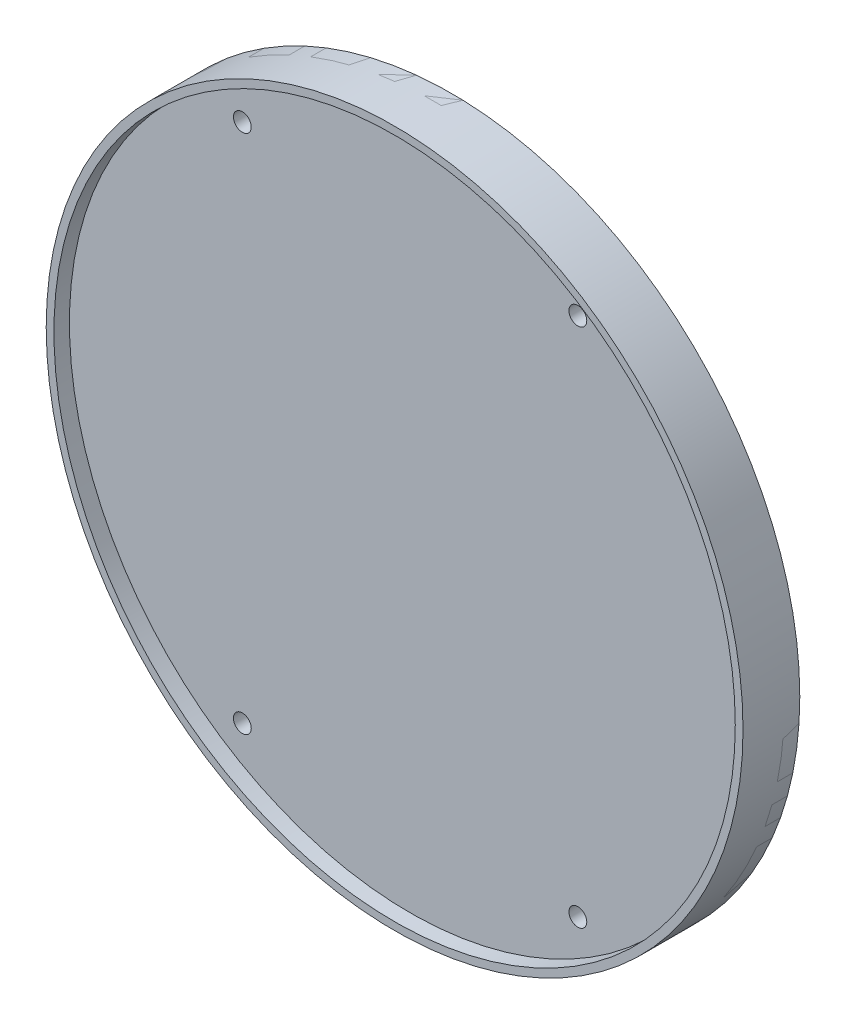
ISO-10303-21;
HEADER;
FILE_DESCRIPTION(('STEP AP214'),'2;1');
FILE_NAME('part.step','',(''),(''),'','','');
FILE_SCHEMA(('AUTOMOTIVE_DESIGN { 1 0 10303 214 1 1 1 1 }'));
ENDSEC;
DATA;
#1=APPLICATION_CONTEXT('core data for automotive mechanical design processes');
#2=APPLICATION_PROTOCOL_DEFINITION('international standard','automotive_design',2000,#1);
#3=PRODUCT_CONTEXT('',#1,'mechanical');
#4=PRODUCT('Part','Part','',(#3));
#5=PRODUCT_RELATED_PRODUCT_CATEGORY('part','',(#4));
#6=PRODUCT_DEFINITION_FORMATION('','',#4);
#7=PRODUCT_DEFINITION_CONTEXT('part definition',#1,'design');
#8=PRODUCT_DEFINITION('design','',#6,#7);
#9=PRODUCT_DEFINITION_SHAPE('','',#8);
#10=(LENGTH_UNIT() NAMED_UNIT(*) SI_UNIT(.MILLI.,.METRE.));
#11=(NAMED_UNIT(*) PLANE_ANGLE_UNIT() SI_UNIT($,.RADIAN.));
#12=(NAMED_UNIT(*) SI_UNIT($,.STERADIAN.) SOLID_ANGLE_UNIT());
#13=UNCERTAINTY_MEASURE_WITH_UNIT(LENGTH_MEASURE(1.E-05),#10,'distance_accuracy_value','');
#14=(GEOMETRIC_REPRESENTATION_CONTEXT(3) GLOBAL_UNCERTAINTY_ASSIGNED_CONTEXT((#13)) GLOBAL_UNIT_ASSIGNED_CONTEXT((#10,
#11,#12)) REPRESENTATION_CONTEXT('',''));
#15=CARTESIAN_POINT('',(0.,0.,0.));
#16=DIRECTION('',(0.,0.,1.));
#17=DIRECTION('',(1.,0.,0.));
#18=AXIS2_PLACEMENT_3D('',#15,#16,#17);
#19=CARTESIAN_POINT('',(-2.60771389965195E-13,0.,0.));
#20=DIRECTION('',(0.,0.,1.));
#21=DIRECTION('',(1.,0.,0.));
#22=AXIS2_PLACEMENT_3D('',#19,#20,#21);
#23=CYLINDRICAL_SURFACE('',#22,67.5);
#24=CARTESIAN_POINT('',(-2.60771389965195E-13,0.,0.));
#25=DIRECTION('',(0.,0.,-1.));
#26=DIRECTION('',(-1.,0.,0.));
#27=AXIS2_PLACEMENT_3D('',#24,#25,#26);
#28=CIRCLE('',#27,67.5);
#29=CARTESIAN_POINT('',(-67.5000000000003,0.,0.));
#30=VERTEX_POINT('',#29);
#31=EDGE_CURVE('E11',#30,#30,#28,.T.);
#32=ORIENTED_EDGE('',*,*,#31,.F.);
#33=EDGE_LOOP('',(#32));
#34=FACE_BOUND('',#33,.T.);
#35=CARTESIAN_POINT('',(-2.60771389965195E-13,0.,3.));
#36=DIRECTION('',(0.,0.,-1.));
#37=DIRECTION('',(-1.,0.,0.));
#38=AXIS2_PLACEMENT_3D('',#35,#36,#37);
#39=CIRCLE('',#38,67.5);
#40=CARTESIAN_POINT('',(-67.5000000000003,0.,3.));
#41=VERTEX_POINT('',#40);
#42=EDGE_CURVE('E45',#41,#41,#39,.T.);
#43=ORIENTED_EDGE('',*,*,#42,.T.);
#44=EDGE_LOOP('',(#43));
#45=FACE_BOUND('',#44,.T.);
#46=ADVANCED_FACE('F38',(#34,#45),#23,.T.);
#47=CARTESIAN_POINT('',(-2.60771389965195E-13,0.,0.));
#48=DIRECTION('',(0.,0.,-1.));
#49=DIRECTION('',(-1.,0.,0.));
#50=AXIS2_PLACEMENT_3D('',#47,#48,#49);
#51=PLANE('',#50);
#52=CARTESIAN_POINT('',(32.500003343355,50.4356025045802,0.));
#53=DIRECTION('',(0.,0.,-1.));
#54=DIRECTION('',(-1.,0.,0.));
#55=AXIS2_PLACEMENT_3D('',#52,#53,#54);
#56=CIRCLE('',#55,3.5687);
#57=CARTESIAN_POINT('',(28.931303343355,50.4356025045802,0.));
#58=VERTEX_POINT('',#57);
#59=EDGE_CURVE('E127',#58,#58,#56,.T.);
#60=ORIENTED_EDGE('',*,*,#59,.F.);
#61=EDGE_LOOP('',(#60));
#62=FACE_BOUND('',#61,.T.);
#63=CARTESIAN_POINT('',(-32.499996656645,50.4356025045802,0.));
#64=DIRECTION('',(0.,0.,-1.));
#65=DIRECTION('',(-1.,0.,0.));
#66=AXIS2_PLACEMENT_3D('',#63,#64,#65);
#67=CIRCLE('',#66,3.5687);
#68=CARTESIAN_POINT('',(-36.068696656645,50.4356025045802,0.));
#69=VERTEX_POINT('',#68);
#70=EDGE_CURVE('E71',#69,#69,#67,.T.);
#71=ORIENTED_EDGE('',*,*,#70,.F.);
#72=EDGE_LOOP('',(#71));
#73=FACE_BOUND('',#72,.T.);
#74=CARTESIAN_POINT('',(-32.5000033433554,-50.4356025045799,0.));
#75=DIRECTION('',(0.,0.,-1.));
#76=DIRECTION('',(-1.,0.,0.));
#77=AXIS2_PLACEMENT_3D('',#74,#75,#76);
#78=CIRCLE('',#77,3.5687);
#79=CARTESIAN_POINT('',(-36.0687033433554,-50.4356025045799,0.));
#80=VERTEX_POINT('',#79);
#81=EDGE_CURVE('E64',#80,#80,#78,.T.);
#82=ORIENTED_EDGE('',*,*,#81,.F.);
#83=EDGE_LOOP('',(#82));
#84=FACE_BOUND('',#83,.T.);
#85=CARTESIAN_POINT('',(32.4999966566446,-50.4356025045799,0.));
#86=DIRECTION('',(0.,0.,-1.));
#87=DIRECTION('',(-1.,0.,0.));
#88=AXIS2_PLACEMENT_3D('',#85,#86,#87);
#89=CIRCLE('',#88,3.5687);
#90=CARTESIAN_POINT('',(28.9312966566446,-50.4356025045799,0.));
#91=VERTEX_POINT('',#90);
#92=EDGE_CURVE('E60',#91,#91,#89,.T.);
#93=ORIENTED_EDGE('',*,*,#92,.F.);
#94=EDGE_LOOP('',(#93));
#95=FACE_BOUND('',#94,.T.);
#96=ORIENTED_EDGE('',*,*,#31,.T.);
#97=EDGE_LOOP('',(#96));
#98=FACE_BOUND('',#97,.T.);
#99=ADVANCED_FACE('F103',(#62,#73,#84,#95,#98),#51,.T.);
#100=CARTESIAN_POINT('',(-2.60771389965195E-13,0.,3.));
#101=DIRECTION('',(0.,0.,-1.));
#102=DIRECTION('',(-1.,0.,0.));
#103=AXIS2_PLACEMENT_3D('',#100,#101,#102);
#104=PLANE('',#103);
#105=CARTESIAN_POINT('',(32.500003343355,50.4356025045802,3.));
#106=DIRECTION('',(0.,0.,-1.));
#107=DIRECTION('',(-1.,0.,0.));
#108=AXIS2_PLACEMENT_3D('',#105,#106,#107);
#109=CIRCLE('',#108,1.72719999999999);
#110=CARTESIAN_POINT('',(30.772803343355,50.4356025045802,3.));
#111=VERTEX_POINT('',#110);
#112=EDGE_CURVE('E41',#111,#111,#109,.T.);
#113=ORIENTED_EDGE('',*,*,#112,.T.);
#114=EDGE_LOOP('',(#113));
#115=FACE_BOUND('',#114,.T.);
#116=CARTESIAN_POINT('',(-32.499996656645,50.4356025045802,3.));
#117=DIRECTION('',(0.,0.,-1.));
#118=DIRECTION('',(-1.,0.,0.));
#119=AXIS2_PLACEMENT_3D('',#116,#117,#118);
#120=CIRCLE('',#119,1.72719999999999);
#121=CARTESIAN_POINT('',(-34.227196656645,50.4356025045802,3.));
#122=VERTEX_POINT('',#121);
#123=EDGE_CURVE('E62',#122,#122,#120,.T.);
#124=ORIENTED_EDGE('',*,*,#123,.T.);
#125=EDGE_LOOP('',(#124));
#126=FACE_BOUND('',#125,.T.);
#127=CARTESIAN_POINT('',(-32.5000033433554,-50.4356025045799,3.));
#128=DIRECTION('',(0.,0.,-1.));
#129=DIRECTION('',(-1.,0.,0.));
#130=AXIS2_PLACEMENT_3D('',#127,#128,#129);
#131=CIRCLE('',#130,1.72719999999999);
#132=CARTESIAN_POINT('',(-34.2272033433553,-50.4356025045799,3.));
#133=VERTEX_POINT('',#132);
#134=EDGE_CURVE('E58',#133,#133,#131,.T.);
#135=ORIENTED_EDGE('',*,*,#134,.T.);
#136=EDGE_LOOP('',(#135));
#137=FACE_BOUND('',#136,.T.);
#138=CARTESIAN_POINT('',(32.4999966566446,-50.4356025045799,3.));
#139=DIRECTION('',(0.,0.,-1.));
#140=DIRECTION('',(-1.,0.,0.));
#141=AXIS2_PLACEMENT_3D('',#138,#139,#140);
#142=CIRCLE('',#141,1.72719999999999);
#143=CARTESIAN_POINT('',(30.7727966566446,-50.4356025045799,3.));
#144=VERTEX_POINT('',#143);
#145=EDGE_CURVE('E50',#144,#144,#142,.T.);
#146=ORIENTED_EDGE('',*,*,#145,.T.);
#147=EDGE_LOOP('',(#146));
#148=FACE_BOUND('',#147,.T.);
#149=ORIENTED_EDGE('',*,*,#42,.F.);
#150=EDGE_LOOP('',(#149));
#151=FACE_BOUND('',#150,.T.);
#152=ADVANCED_FACE('F100',(#115,#126,#137,#148,#151),#104,.F.);
#153=CARTESIAN_POINT('',(32.4999966566446,-50.4356025045799,0.));
#154=DIRECTION('',(0.,0.,-1.));
#155=DIRECTION('',(-1.,0.,0.));
#156=AXIS2_PLACEMENT_3D('',#153,#154,#155);
#157=CYLINDRICAL_SURFACE('',#156,1.72719999999999);
#158=CARTESIAN_POINT('',(32.4999966566446,-50.4356025045799,2.11840342189749));
#159=DIRECTION('',(0.,0.,-1.));
#160=DIRECTION('',(-1.,0.,0.));
#161=AXIS2_PLACEMENT_3D('',#158,#159,#160);
#162=CIRCLE('',#161,1.72719999999999);
#163=CARTESIAN_POINT('',(30.7727966566446,-50.4356025045799,2.11840342189749));
#164=VERTEX_POINT('',#163);
#165=EDGE_CURVE('E53',#164,#164,#162,.T.);
#166=ORIENTED_EDGE('',*,*,#165,.T.);
#167=EDGE_LOOP('',(#166));
#168=FACE_BOUND('',#167,.T.);
#169=ORIENTED_EDGE('',*,*,#145,.F.);
#170=EDGE_LOOP('',(#169));
#171=FACE_BOUND('',#170,.T.);
#172=ADVANCED_FACE('F86',(#168,#171),#157,.F.);
#173=CARTESIAN_POINT('',(32.4999966566446,-50.4356025045799,0.));
#174=DIRECTION('',(0.,0.,-1.));
#175=DIRECTION('',(-1.,0.,0.));
#176=AXIS2_PLACEMENT_3D('',#173,#174,#175);
#177=CONICAL_SURFACE('',#176,3.5687,0.715584993317676);
#178=ORIENTED_EDGE('',*,*,#165,.F.);
#179=EDGE_LOOP('',(#178));
#180=FACE_BOUND('',#179,.T.);
#181=ORIENTED_EDGE('',*,*,#92,.T.);
#182=EDGE_LOOP('',(#181));
#183=FACE_BOUND('',#182,.T.);
#184=ADVANCED_FACE('F89',(#180,#183),#177,.F.);
#185=CARTESIAN_POINT('',(-32.5000033433554,-50.4356025045799,0.));
#186=DIRECTION('',(0.,0.,-1.));
#187=DIRECTION('',(-1.,0.,0.));
#188=AXIS2_PLACEMENT_3D('',#185,#186,#187);
#189=CYLINDRICAL_SURFACE('',#188,1.72719999999999);
#190=CARTESIAN_POINT('',(-32.5000033433554,-50.4356025045799,2.11840342189749));
#191=DIRECTION('',(0.,0.,-1.));
#192=DIRECTION('',(-1.,0.,0.));
#193=AXIS2_PLACEMENT_3D('',#190,#191,#192);
#194=CIRCLE('',#193,1.72719999999999);
#195=CARTESIAN_POINT('',(-34.2272033433553,-50.4356025045799,2.11840342189749));
#196=VERTEX_POINT('',#195);
#197=EDGE_CURVE('E61',#196,#196,#194,.T.);
#198=ORIENTED_EDGE('',*,*,#197,.T.);
#199=EDGE_LOOP('',(#198));
#200=FACE_BOUND('',#199,.T.);
#201=ORIENTED_EDGE('',*,*,#134,.F.);
#202=EDGE_LOOP('',(#201));
#203=FACE_BOUND('',#202,.T.);
#204=ADVANCED_FACE('F91',(#200,#203),#189,.F.);
#205=CARTESIAN_POINT('',(-32.5000033433554,-50.4356025045799,0.));
#206=DIRECTION('',(0.,0.,-1.));
#207=DIRECTION('',(-1.,0.,0.));
#208=AXIS2_PLACEMENT_3D('',#205,#206,#207);
#209=CONICAL_SURFACE('',#208,3.5687,0.715584993317676);
#210=ORIENTED_EDGE('',*,*,#197,.F.);
#211=EDGE_LOOP('',(#210));
#212=FACE_BOUND('',#211,.T.);
#213=ORIENTED_EDGE('',*,*,#81,.T.);
#214=EDGE_LOOP('',(#213));
#215=FACE_BOUND('',#214,.T.);
#216=ADVANCED_FACE('F97',(#212,#215),#209,.F.);
#217=CARTESIAN_POINT('',(-32.499996656645,50.4356025045802,0.));
#218=DIRECTION('',(0.,0.,-1.));
#219=DIRECTION('',(-1.,0.,0.));
#220=AXIS2_PLACEMENT_3D('',#217,#218,#219);
#221=CYLINDRICAL_SURFACE('',#220,1.72719999999999);
#222=CARTESIAN_POINT('',(-32.499996656645,50.4356025045802,2.11840342189749));
#223=DIRECTION('',(0.,0.,-1.));
#224=DIRECTION('',(-1.,0.,0.));
#225=AXIS2_PLACEMENT_3D('',#222,#223,#224);
#226=CIRCLE('',#225,1.72719999999999);
#227=CARTESIAN_POINT('',(-34.227196656645,50.4356025045802,2.11840342189749));
#228=VERTEX_POINT('',#227);
#229=EDGE_CURVE('E65',#228,#228,#226,.T.);
#230=ORIENTED_EDGE('',*,*,#229,.T.);
#231=EDGE_LOOP('',(#230));
#232=FACE_BOUND('',#231,.T.);
#233=ORIENTED_EDGE('',*,*,#123,.F.);
#234=EDGE_LOOP('',(#233));
#235=FACE_BOUND('',#234,.T.);
#236=ADVANCED_FACE('F142',(#232,#235),#221,.F.);
#237=CARTESIAN_POINT('',(-32.499996656645,50.4356025045802,0.));
#238=DIRECTION('',(0.,0.,-1.));
#239=DIRECTION('',(-1.,0.,0.));
#240=AXIS2_PLACEMENT_3D('',#237,#238,#239);
#241=CONICAL_SURFACE('',#240,3.5687,0.715584993317676);
#242=ORIENTED_EDGE('',*,*,#229,.F.);
#243=EDGE_LOOP('',(#242));
#244=FACE_BOUND('',#243,.T.);
#245=ORIENTED_EDGE('',*,*,#70,.T.);
#246=EDGE_LOOP('',(#245));
#247=FACE_BOUND('',#246,.T.);
#248=ADVANCED_FACE('F148',(#244,#247),#241,.F.);
#249=CARTESIAN_POINT('',(32.500003343355,50.4356025045802,0.));
#250=DIRECTION('',(0.,0.,-1.));
#251=DIRECTION('',(-1.,0.,0.));
#252=AXIS2_PLACEMENT_3D('',#249,#250,#251);
#253=CYLINDRICAL_SURFACE('',#252,1.72719999999999);
#254=CARTESIAN_POINT('',(32.500003343355,50.4356025045802,2.11840342189749));
#255=DIRECTION('',(0.,0.,-1.));
#256=DIRECTION('',(-1.,0.,0.));
#257=AXIS2_PLACEMENT_3D('',#254,#255,#256);
#258=CIRCLE('',#257,1.72719999999999);
#259=CARTESIAN_POINT('',(30.772803343355,50.4356025045802,2.11840342189749));
#260=VERTEX_POINT('',#259);
#261=EDGE_CURVE('E125',#260,#260,#258,.T.);
#262=ORIENTED_EDGE('',*,*,#261,.T.);
#263=EDGE_LOOP('',(#262));
#264=FACE_BOUND('',#263,.T.);
#265=ORIENTED_EDGE('',*,*,#112,.F.);
#266=EDGE_LOOP('',(#265));
#267=FACE_BOUND('',#266,.T.);
#268=ADVANCED_FACE('F154',(#264,#267),#253,.F.);
#269=CARTESIAN_POINT('',(32.500003343355,50.4356025045802,0.));
#270=DIRECTION('',(0.,0.,-1.));
#271=DIRECTION('',(-1.,0.,0.));
#272=AXIS2_PLACEMENT_3D('',#269,#270,#271);
#273=CONICAL_SURFACE('',#272,3.5687,0.715584993317676);
#274=ORIENTED_EDGE('',*,*,#261,.F.);
#275=EDGE_LOOP('',(#274));
#276=FACE_BOUND('',#275,.T.);
#277=ORIENTED_EDGE('',*,*,#59,.T.);
#278=EDGE_LOOP('',(#277));
#279=FACE_BOUND('',#278,.T.);
#280=ADVANCED_FACE('F134',(#276,#279),#273,.F.);
#281=CLOSED_SHELL('',(#46,#99,#152,#172,#184,#204,#216,#236,#248,#268,#280));
#282=MANIFOLD_SOLID_BREP('B2',#281);
#283=CARTESIAN_POINT('',(-2.60771389965195E-13,0.,11.));
#284=DIRECTION('',(0.,0.,-1.));
#285=DIRECTION('',(-1.,0.,0.));
#286=AXIS2_PLACEMENT_3D('',#283,#284,#285);
#287=CYLINDRICAL_SURFACE('',#286,67.5);
#288=CARTESIAN_POINT('',(-2.60771389965195E-13,0.,11.));
#289=DIRECTION('',(0.,0.,1.));
#290=DIRECTION('',(1.,0.,0.));
#291=AXIS2_PLACEMENT_3D('',#288,#289,#290);
#292=CIRCLE('',#291,67.5);
#293=CARTESIAN_POINT('',(67.4999999999998,0.,11.));
#294=VERTEX_POINT('',#293);
#295=EDGE_CURVE('E37',#294,#294,#292,.T.);
#296=ORIENTED_EDGE('',*,*,#295,.F.);
#297=EDGE_LOOP('',(#296));
#298=FACE_BOUND('',#297,.T.);
#299=CARTESIAN_POINT('',(-2.60771389965195E-13,0.,0.));
#300=DIRECTION('',(0.,0.,1.));
#301=DIRECTION('',(1.,0.,0.));
#302=AXIS2_PLACEMENT_3D('',#299,#300,#301);
#303=CIRCLE('',#302,67.5);
#304=CARTESIAN_POINT('',(67.4999999999998,0.,0.));
#305=VERTEX_POINT('',#304);
#306=EDGE_CURVE('E229',#305,#305,#303,.T.);
#307=ORIENTED_EDGE('',*,*,#306,.T.);
#308=EDGE_LOOP('',(#307));
#309=FACE_BOUND('',#308,.T.);
#310=ADVANCED_FACE('F222',(#298,#309),#287,.T.);
#311=CARTESIAN_POINT('',(-2.60771389965195E-13,0.,11.));
#312=DIRECTION('',(0.,0.,1.));
#313=DIRECTION('',(1.,0.,0.));
#314=AXIS2_PLACEMENT_3D('',#311,#312,#313);
#315=PLANE('',#314);
#316=CARTESIAN_POINT('',(-2.60771389965195E-13,0.,11.));
#317=DIRECTION('',(0.,0.,1.));
#318=DIRECTION('',(1.,0.,0.));
#319=AXIS2_PLACEMENT_3D('',#316,#317,#318);
#320=CIRCLE('',#319,66.);
#321=CARTESIAN_POINT('',(65.9999999999998,0.,11.));
#322=VERTEX_POINT('',#321);
#323=EDGE_CURVE('E265',#322,#322,#320,.T.);
#324=ORIENTED_EDGE('',*,*,#323,.F.);
#325=EDGE_LOOP('',(#324));
#326=FACE_BOUND('',#325,.T.);
#327=ORIENTED_EDGE('',*,*,#295,.T.);
#328=EDGE_LOOP('',(#327));
#329=FACE_BOUND('',#328,.T.);
#330=ADVANCED_FACE('F281',(#326,#329),#315,.T.);
#331=CARTESIAN_POINT('',(-2.60771389965195E-13,0.,0.));
#332=DIRECTION('',(0.,0.,1.));
#333=DIRECTION('',(1.,0.,0.));
#334=AXIS2_PLACEMENT_3D('',#331,#332,#333);
#335=PLANE('',#334);
#336=CARTESIAN_POINT('',(-2.60771389965195E-13,0.,0.));
#337=DIRECTION('',(0.,0.,-1.));
#338=DIRECTION('',(-1.,0.,0.));
#339=AXIS2_PLACEMENT_3D('',#336,#337,#338);
#340=CIRCLE('',#339,66.);
#341=CARTESIAN_POINT('',(-66.0000000000003,0.,0.));
#342=VERTEX_POINT('',#341);
#343=EDGE_CURVE('E237',#342,#342,#340,.T.);
#344=ORIENTED_EDGE('',*,*,#343,.F.);
#345=EDGE_LOOP('',(#344));
#346=FACE_BOUND('',#345,.T.);
#347=ORIENTED_EDGE('',*,*,#306,.F.);
#348=EDGE_LOOP('',(#347));
#349=FACE_BOUND('',#348,.T.);
#350=ADVANCED_FACE('F278',(#346,#349),#335,.F.);
#351=CARTESIAN_POINT('',(-2.60771389965195E-13,0.,3.));
#352=DIRECTION('',(0.,0.,-1.));
#353=DIRECTION('',(-1.,0.,0.));
#354=AXIS2_PLACEMENT_3D('',#351,#352,#353);
#355=CYLINDRICAL_SURFACE('',#354,66.);
#356=CARTESIAN_POINT('',(-2.60771389965195E-13,0.,3.));
#357=DIRECTION('',(0.,0.,-1.));
#358=DIRECTION('',(-1.,0.,0.));
#359=AXIS2_PLACEMENT_3D('',#356,#357,#358);
#360=CIRCLE('',#359,66.);
#361=CARTESIAN_POINT('',(-66.0000000000003,0.,3.));
#362=VERTEX_POINT('',#361);
#363=EDGE_CURVE('E234',#362,#362,#360,.T.);
#364=ORIENTED_EDGE('',*,*,#363,.F.);
#365=EDGE_LOOP('',(#364));
#366=FACE_BOUND('',#365,.T.);
#367=ORIENTED_EDGE('',*,*,#343,.T.);
#368=EDGE_LOOP('',(#367));
#369=FACE_BOUND('',#368,.T.);
#370=ADVANCED_FACE('F276',(#366,#369),#355,.F.);
#371=CARTESIAN_POINT('',(-2.60771389965195E-13,0.,3.));
#372=DIRECTION('',(0.,0.,-1.));
#373=DIRECTION('',(-1.,0.,0.));
#374=AXIS2_PLACEMENT_3D('',#371,#372,#373);
#375=PLANE('',#374);
#376=CARTESIAN_POINT('',(32.500003343355,50.4356025045802,3.));
#377=DIRECTION('',(0.,0.,-1.));
#378=DIRECTION('',(-1.,0.,0.));
#379=AXIS2_PLACEMENT_3D('',#376,#377,#378);
#380=CIRCLE('',#379,1.72719999999999);
#381=CARTESIAN_POINT('',(30.772803343355,50.4356025045802,3.));
#382=VERTEX_POINT('',#381);
#383=EDGE_CURVE('E225',#382,#382,#380,.T.);
#384=ORIENTED_EDGE('',*,*,#383,.F.);
#385=EDGE_LOOP('',(#384));
#386=FACE_BOUND('',#385,.T.);
#387=CARTESIAN_POINT('',(-32.499996656645,50.4356025045802,3.));
#388=DIRECTION('',(0.,0.,-1.));
#389=DIRECTION('',(-1.,0.,0.));
#390=AXIS2_PLACEMENT_3D('',#387,#388,#389);
#391=CIRCLE('',#390,1.72719999999999);
#392=CARTESIAN_POINT('',(-34.227196656645,50.4356025045802,3.));
#393=VERTEX_POINT('',#392);
#394=EDGE_CURVE('E247',#393,#393,#391,.T.);
#395=ORIENTED_EDGE('',*,*,#394,.F.);
#396=EDGE_LOOP('',(#395));
#397=FACE_BOUND('',#396,.T.);
#398=CARTESIAN_POINT('',(-32.5000033433554,-50.4356025045799,3.));
#399=DIRECTION('',(0.,0.,-1.));
#400=DIRECTION('',(-1.,0.,0.));
#401=AXIS2_PLACEMENT_3D('',#398,#399,#400);
#402=CIRCLE('',#401,1.72719999999999);
#403=CARTESIAN_POINT('',(-34.2272033433553,-50.4356025045799,3.));
#404=VERTEX_POINT('',#403);
#405=EDGE_CURVE('E244',#404,#404,#402,.T.);
#406=ORIENTED_EDGE('',*,*,#405,.F.);
#407=EDGE_LOOP('',(#406));
#408=FACE_BOUND('',#407,.T.);
#409=CARTESIAN_POINT('',(32.4999966566446,-50.4356025045799,3.));
#410=DIRECTION('',(0.,0.,-1.));
#411=DIRECTION('',(-1.,0.,0.));
#412=AXIS2_PLACEMENT_3D('',#409,#410,#411);
#413=CIRCLE('',#412,1.72719999999999);
#414=CARTESIAN_POINT('',(30.7727966566446,-50.4356025045799,3.));
#415=VERTEX_POINT('',#414);
#416=EDGE_CURVE('E243',#415,#415,#413,.T.);
#417=ORIENTED_EDGE('',*,*,#416,.F.);
#418=EDGE_LOOP('',(#417));
#419=FACE_BOUND('',#418,.T.);
#420=ORIENTED_EDGE('',*,*,#363,.T.);
#421=EDGE_LOOP('',(#420));
#422=FACE_BOUND('',#421,.T.);
#423=ADVANCED_FACE('F297',(#386,#397,#408,#419,#422),#375,.T.);
#424=CARTESIAN_POINT('',(-2.60771389965195E-13,0.,8.));
#425=DIRECTION('',(0.,0.,1.));
#426=DIRECTION('',(1.,0.,0.));
#427=AXIS2_PLACEMENT_3D('',#424,#425,#426);
#428=CYLINDRICAL_SURFACE('',#427,66.);
#429=CARTESIAN_POINT('',(-2.60771389965195E-13,0.,8.));
#430=DIRECTION('',(0.,0.,1.));
#431=DIRECTION('',(1.,0.,0.));
#432=AXIS2_PLACEMENT_3D('',#429,#430,#431);
#433=CIRCLE('',#432,66.);
#434=CARTESIAN_POINT('',(65.9999999999998,0.,8.));
#435=VERTEX_POINT('',#434);
#436=EDGE_CURVE('E266',#435,#435,#433,.T.);
#437=ORIENTED_EDGE('',*,*,#436,.F.);
#438=EDGE_LOOP('',(#437));
#439=FACE_BOUND('',#438,.T.);
#440=ORIENTED_EDGE('',*,*,#323,.T.);
#441=EDGE_LOOP('',(#440));
#442=FACE_BOUND('',#441,.T.);
#443=ADVANCED_FACE('F301',(#439,#442),#428,.F.);
#444=CARTESIAN_POINT('',(-2.60771389965195E-13,0.,8.));
#445=DIRECTION('',(0.,0.,1.));
#446=DIRECTION('',(1.,0.,0.));
#447=AXIS2_PLACEMENT_3D('',#444,#445,#446);
#448=PLANE('',#447);
#449=CARTESIAN_POINT('',(32.500003343355,50.4356025045802,8.));
#450=DIRECTION('',(0.,0.,1.));
#451=DIRECTION('',(1.,0.,0.));
#452=AXIS2_PLACEMENT_3D('',#449,#450,#451);
#453=CIRCLE('',#452,1.72719999999999);
#454=CARTESIAN_POINT('',(34.227203343355,50.4356025045802,8.));
#455=VERTEX_POINT('',#454);
#456=EDGE_CURVE('E250',#455,#455,#453,.T.);
#457=ORIENTED_EDGE('',*,*,#456,.F.);
#458=EDGE_LOOP('',(#457));
#459=FACE_BOUND('',#458,.T.);
#460=CARTESIAN_POINT('',(-32.499996656645,50.4356025045802,8.));
#461=DIRECTION('',(0.,0.,1.));
#462=DIRECTION('',(1.,0.,0.));
#463=AXIS2_PLACEMENT_3D('',#460,#461,#462);
#464=CIRCLE('',#463,1.72719999999999);
#465=CARTESIAN_POINT('',(-30.772796656645,50.4356025045802,8.));
#466=VERTEX_POINT('',#465);
#467=EDGE_CURVE('E248',#466,#466,#464,.T.);
#468=ORIENTED_EDGE('',*,*,#467,.F.);
#469=EDGE_LOOP('',(#468));
#470=FACE_BOUND('',#469,.T.);
#471=CARTESIAN_POINT('',(-32.5000033433554,-50.4356025045799,8.));
#472=DIRECTION('',(0.,0.,1.));
#473=DIRECTION('',(1.,0.,0.));
#474=AXIS2_PLACEMENT_3D('',#471,#472,#473);
#475=CIRCLE('',#474,1.72719999999999);
#476=CARTESIAN_POINT('',(-30.7728033433554,-50.4356025045799,8.));
#477=VERTEX_POINT('',#476);
#478=EDGE_CURVE('E245',#477,#477,#475,.T.);
#479=ORIENTED_EDGE('',*,*,#478,.F.);
#480=EDGE_LOOP('',(#479));
#481=FACE_BOUND('',#480,.T.);
#482=CARTESIAN_POINT('',(32.4999966566446,-50.4356025045799,8.));
#483=DIRECTION('',(0.,0.,1.));
#484=DIRECTION('',(1.,0.,0.));
#485=AXIS2_PLACEMENT_3D('',#482,#483,#484);
#486=CIRCLE('',#485,1.72719999999999);
#487=CARTESIAN_POINT('',(34.2271966566446,-50.4356025045799,8.));
#488=VERTEX_POINT('',#487);
#489=EDGE_CURVE('E240',#488,#488,#486,.T.);
#490=ORIENTED_EDGE('',*,*,#489,.F.);
#491=EDGE_LOOP('',(#490));
#492=FACE_BOUND('',#491,.T.);
#493=ORIENTED_EDGE('',*,*,#436,.T.);
#494=EDGE_LOOP('',(#493));
#495=FACE_BOUND('',#494,.T.);
#496=ADVANCED_FACE('F305',(#459,#470,#481,#492,#495),#448,.T.);
#497=CARTESIAN_POINT('',(32.4999966566446,-50.4356025045799,0.));
#498=DIRECTION('',(0.,0.,-1.));
#499=DIRECTION('',(-1.,0.,0.));
#500=AXIS2_PLACEMENT_3D('',#497,#498,#499);
#501=CYLINDRICAL_SURFACE('',#500,1.72719999999999);
#502=ORIENTED_EDGE('',*,*,#416,.T.);
#503=EDGE_LOOP('',(#502));
#504=FACE_BOUND('',#503,.T.);
#505=ORIENTED_EDGE('',*,*,#489,.T.);
#506=EDGE_LOOP('',(#505));
#507=FACE_BOUND('',#506,.T.);
#508=ADVANCED_FACE('F309',(#504,#507),#501,.F.);
#509=CARTESIAN_POINT('',(-32.5000033433554,-50.4356025045799,0.));
#510=DIRECTION('',(0.,0.,-1.));
#511=DIRECTION('',(-1.,0.,0.));
#512=AXIS2_PLACEMENT_3D('',#509,#510,#511);
#513=CYLINDRICAL_SURFACE('',#512,1.72719999999999);
#514=ORIENTED_EDGE('',*,*,#405,.T.);
#515=EDGE_LOOP('',(#514));
#516=FACE_BOUND('',#515,.T.);
#517=ORIENTED_EDGE('',*,*,#478,.T.);
#518=EDGE_LOOP('',(#517));
#519=FACE_BOUND('',#518,.T.);
#520=ADVANCED_FACE('F313',(#516,#519),#513,.F.);
#521=CARTESIAN_POINT('',(-32.499996656645,50.4356025045802,0.));
#522=DIRECTION('',(0.,0.,-1.));
#523=DIRECTION('',(-1.,0.,0.));
#524=AXIS2_PLACEMENT_3D('',#521,#522,#523);
#525=CYLINDRICAL_SURFACE('',#524,1.72719999999999);
#526=ORIENTED_EDGE('',*,*,#394,.T.);
#527=EDGE_LOOP('',(#526));
#528=FACE_BOUND('',#527,.T.);
#529=ORIENTED_EDGE('',*,*,#467,.T.);
#530=EDGE_LOOP('',(#529));
#531=FACE_BOUND('',#530,.T.);
#532=ADVANCED_FACE('F317',(#528,#531),#525,.F.);
#533=CARTESIAN_POINT('',(32.500003343355,50.4356025045802,0.));
#534=DIRECTION('',(0.,0.,-1.));
#535=DIRECTION('',(-1.,0.,0.));
#536=AXIS2_PLACEMENT_3D('',#533,#534,#535);
#537=CYLINDRICAL_SURFACE('',#536,1.72719999999999);
#538=ORIENTED_EDGE('',*,*,#456,.T.);
#539=EDGE_LOOP('',(#538));
#540=FACE_BOUND('',#539,.T.);
#541=ORIENTED_EDGE('',*,*,#383,.T.);
#542=EDGE_LOOP('',(#541));
#543=FACE_BOUND('',#542,.T.);
#544=ADVANCED_FACE('F321',(#540,#543),#537,.F.);
#545=CLOSED_SHELL('',(#310,#330,#350,#370,#423,#443,#496,#508,#520,#532,#544));
#546=MANIFOLD_SOLID_BREP('B6',#545);
#547=ADVANCED_BREP_SHAPE_REPRESENTATION('',(#18,#282,#546),#14);
#548=SHAPE_DEFINITION_REPRESENTATION(#9,#547);
ENDSEC;
END-ISO-10303-21;
